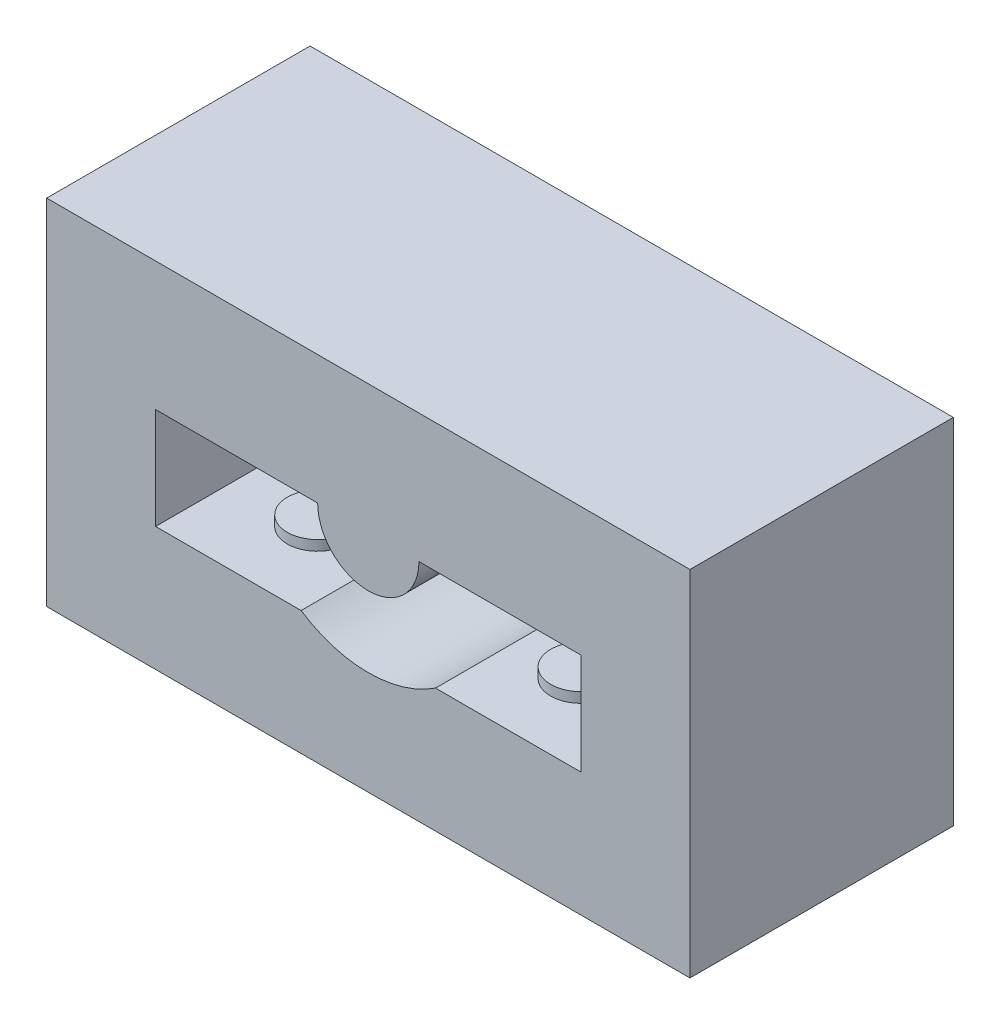
ISO-10303-21;
HEADER;
FILE_DESCRIPTION(('STEP AP214'),'2;1');
FILE_NAME('part.step','',(''),(''),'','','');
FILE_SCHEMA(('AUTOMOTIVE_DESIGN { 1 0 10303 214 1 1 1 1 }'));
ENDSEC;
DATA;
#1=APPLICATION_CONTEXT('core data for automotive mechanical design processes');
#2=APPLICATION_PROTOCOL_DEFINITION('international standard','automotive_design',2000,#1);
#3=PRODUCT_CONTEXT('',#1,'mechanical');
#4=PRODUCT('Part','Part','',(#3));
#5=PRODUCT_RELATED_PRODUCT_CATEGORY('part','',(#4));
#6=PRODUCT_DEFINITION_FORMATION('','',#4);
#7=PRODUCT_DEFINITION_CONTEXT('part definition',#1,'design');
#8=PRODUCT_DEFINITION('design','',#6,#7);
#9=PRODUCT_DEFINITION_SHAPE('','',#8);
#10=(LENGTH_UNIT() NAMED_UNIT(*) SI_UNIT(.MILLI.,.METRE.));
#11=(NAMED_UNIT(*) PLANE_ANGLE_UNIT() SI_UNIT($,.RADIAN.));
#12=(NAMED_UNIT(*) SI_UNIT($,.STERADIAN.) SOLID_ANGLE_UNIT());
#13=UNCERTAINTY_MEASURE_WITH_UNIT(LENGTH_MEASURE(1.E-05),#10,'distance_accuracy_value','');
#14=(GEOMETRIC_REPRESENTATION_CONTEXT(3) GLOBAL_UNCERTAINTY_ASSIGNED_CONTEXT((#13)) GLOBAL_UNIT_ASSIGNED_CONTEXT((#10,
#11,#12)) REPRESENTATION_CONTEXT('',''));
#15=CARTESIAN_POINT('',(0.,0.,0.));
#16=DIRECTION('',(0.,0.,1.));
#17=DIRECTION('',(1.,0.,0.));
#18=AXIS2_PLACEMENT_3D('',#15,#16,#17);
#19=CARTESIAN_POINT('',(3.3166247903554,-5.,13.));
#20=DIRECTION('',(0.,1.,0.));
#21=DIRECTION('',(0.,0.,1.));
#22=AXIS2_PLACEMENT_3D('',#19,#20,#21);
#23=PLANE('',#22);
#24=DIRECTION('',(1.,0.,0.));
#25=VECTOR('',#24,1.);
#26=CARTESIAN_POINT('',(3.3166247903554,-5.,5.));
#27=LINE('',#26,#25);
#28=CARTESIAN_POINT('',(3.3166247903554,-5.,5.));
#29=VERTEX_POINT('',#28);
#30=CARTESIAN_POINT('',(10.5,-5.,5.));
#31=VERTEX_POINT('',#30);
#32=EDGE_CURVE('E173',#29,#31,#27,.T.);
#33=ORIENTED_EDGE('',*,*,#32,.F.);
#34=DIRECTION('',(0.,0.,-1.));
#35=VECTOR('',#34,1.);
#36=CARTESIAN_POINT('',(3.3166247903554,-5.,13.));
#37=LINE('',#36,#35);
#38=CARTESIAN_POINT('',(3.3166247903554,-5.,13.));
#39=VERTEX_POINT('',#38);
#40=EDGE_CURVE('E11',#39,#29,#37,.T.);
#41=ORIENTED_EDGE('',*,*,#40,.F.);
#42=DIRECTION('',(1.,0.,0.));
#43=VECTOR('',#42,1.);
#44=CARTESIAN_POINT('',(3.3166247903554,-5.,13.));
#45=LINE('',#44,#43);
#46=CARTESIAN_POINT('',(10.5,-5.,13.));
#47=VERTEX_POINT('',#46);
#48=EDGE_CURVE('E154',#39,#47,#45,.T.);
#49=ORIENTED_EDGE('',*,*,#48,.T.);
#50=DIRECTION('',(0.,0.,-1.));
#51=VECTOR('',#50,1.);
#52=CARTESIAN_POINT('',(10.5,-5.,13.));
#53=LINE('',#52,#51);
#54=EDGE_CURVE('E39',#47,#31,#53,.T.);
#55=ORIENTED_EDGE('',*,*,#54,.T.);
#56=EDGE_LOOP('',(#33,#41,#49,#55));
#57=FACE_BOUND('',#56,.T.);
#58=CARTESIAN_POINT('',(6.5,-5.,9.));
#59=DIRECTION('',(0.,1.,0.));
#60=DIRECTION('',(0.,0.,1.));
#61=AXIS2_PLACEMENT_3D('',#58,#59,#60);
#62=CIRCLE('',#61,1.5);
#63=CARTESIAN_POINT('',(6.5,-5.,10.5));
#64=VERTEX_POINT('',#63);
#65=EDGE_CURVE('E405',#64,#64,#62,.T.);
#66=ORIENTED_EDGE('',*,*,#65,.F.);
#67=EDGE_LOOP('',(#66));
#68=FACE_BOUND('',#67,.T.);
#69=ADVANCED_FACE('F31',(#57,#68),#23,.T.);
#70=CARTESIAN_POINT('',(-3.3166247903554,-5.,13.));
#71=DIRECTION('',(0.,1.,0.));
#72=DIRECTION('',(0.,0.,1.));
#73=AXIS2_PLACEMENT_3D('',#70,#71,#72);
#74=PLANE('',#73);
#75=DIRECTION('',(1.,0.,0.));
#76=VECTOR('',#75,1.);
#77=CARTESIAN_POINT('',(-3.3166247903554,-5.,5.));
#78=LINE('',#77,#76);
#79=CARTESIAN_POINT('',(-10.5,-5.,5.));
#80=VERTEX_POINT('',#79);
#81=CARTESIAN_POINT('',(-3.3166247903554,-5.,5.));
#82=VERTEX_POINT('',#81);
#83=EDGE_CURVE('E155',#80,#82,#78,.T.);
#84=ORIENTED_EDGE('',*,*,#83,.F.);
#85=DIRECTION('',(0.,0.,-1.));
#86=VECTOR('',#85,1.);
#87=CARTESIAN_POINT('',(-10.5,-5.,13.));
#88=LINE('',#87,#86);
#89=CARTESIAN_POINT('',(-10.5,-5.,13.));
#90=VERTEX_POINT('',#89);
#91=EDGE_CURVE('E189',#90,#80,#88,.T.);
#92=ORIENTED_EDGE('',*,*,#91,.F.);
#93=DIRECTION('',(1.,0.,0.));
#94=VECTOR('',#93,1.);
#95=CARTESIAN_POINT('',(-3.3166247903554,-5.,13.));
#96=LINE('',#95,#94);
#97=CARTESIAN_POINT('',(-3.3166247903554,-5.,13.));
#98=VERTEX_POINT('',#97);
#99=EDGE_CURVE('E168',#90,#98,#96,.T.);
#100=ORIENTED_EDGE('',*,*,#99,.T.);
#101=DIRECTION('',(0.,0.,-1.));
#102=VECTOR('',#101,1.);
#103=CARTESIAN_POINT('',(-3.3166247903554,-5.,13.));
#104=LINE('',#103,#102);
#105=EDGE_CURVE('E170',#98,#82,#104,.T.);
#106=ORIENTED_EDGE('',*,*,#105,.T.);
#107=EDGE_LOOP('',(#84,#92,#100,#106));
#108=FACE_BOUND('',#107,.T.);
#109=CARTESIAN_POINT('',(-6.5,-5.,9.));
#110=DIRECTION('',(0.,1.,0.));
#111=DIRECTION('',(0.,0.,1.));
#112=AXIS2_PLACEMENT_3D('',#109,#110,#111);
#113=CIRCLE('',#112,1.5);
#114=CARTESIAN_POINT('',(-6.5,-5.,10.5));
#115=VERTEX_POINT('',#114);
#116=EDGE_CURVE('E404',#115,#115,#113,.T.);
#117=ORIENTED_EDGE('',*,*,#116,.F.);
#118=EDGE_LOOP('',(#117));
#119=FACE_BOUND('',#118,.T.);
#120=ADVANCED_FACE('F225',(#108,#119),#74,.T.);
#121=CARTESIAN_POINT('',(0.,0.,13.));
#122=DIRECTION('',(0.,0.,1.));
#123=DIRECTION('',(1.,0.,0.));
#124=AXIS2_PLACEMENT_3D('',#121,#122,#123);
#125=PLANE('',#124);
#126=ORIENTED_EDGE('',*,*,#48,.F.);
#127=CARTESIAN_POINT('',(0.,0.,13.));
#128=DIRECTION('',(0.,0.,1.));
#129=DIRECTION('',(-1.,0.,0.));
#130=AXIS2_PLACEMENT_3D('',#127,#128,#129);
#131=CIRCLE('',#130,6.);
#132=EDGE_CURVE('E152',#98,#39,#131,.T.);
#133=ORIENTED_EDGE('',*,*,#132,.F.);
#134=ORIENTED_EDGE('',*,*,#99,.F.);
#135=DIRECTION('',(0.,-1.,0.));
#136=VECTOR('',#135,1.);
#137=CARTESIAN_POINT('',(-10.5,-5.,13.));
#138=LINE('',#137,#136);
#139=CARTESIAN_POINT('',(-10.5,0.,13.));
#140=VERTEX_POINT('',#139);
#141=EDGE_CURVE('E165',#140,#90,#138,.T.);
#142=ORIENTED_EDGE('',*,*,#141,.F.);
#143=DIRECTION('',(-1.,0.,0.));
#144=VECTOR('',#143,1.);
#145=CARTESIAN_POINT('',(-2.5,0.,13.));
#146=LINE('',#145,#144);
#147=CARTESIAN_POINT('',(-2.5,0.,13.));
#148=VERTEX_POINT('',#147);
#149=EDGE_CURVE('E163',#148,#140,#146,.T.);
#150=ORIENTED_EDGE('',*,*,#149,.F.);
#151=CARTESIAN_POINT('',(0.,0.,13.));
#152=DIRECTION('',(0.,0.,-1.));
#153=DIRECTION('',(-1.,0.,0.));
#154=AXIS2_PLACEMENT_3D('',#151,#152,#153);
#155=CIRCLE('',#154,2.5);
#156=CARTESIAN_POINT('',(2.5,0.,13.));
#157=VERTEX_POINT('',#156);
#158=EDGE_CURVE('E161',#157,#148,#155,.T.);
#159=ORIENTED_EDGE('',*,*,#158,.F.);
#160=DIRECTION('',(-1.,0.,0.));
#161=VECTOR('',#160,1.);
#162=CARTESIAN_POINT('',(2.5,0.,13.));
#163=LINE('',#162,#161);
#164=CARTESIAN_POINT('',(10.5,0.,13.));
#165=VERTEX_POINT('',#164);
#166=EDGE_CURVE('E159',#165,#157,#163,.T.);
#167=ORIENTED_EDGE('',*,*,#166,.F.);
#168=DIRECTION('',(0.,1.,0.));
#169=VECTOR('',#168,1.);
#170=CARTESIAN_POINT('',(10.5,0.,13.));
#171=LINE('',#170,#169);
#172=EDGE_CURVE('E157',#47,#165,#171,.T.);
#173=ORIENTED_EDGE('',*,*,#172,.F.);
#174=EDGE_LOOP('',(#126,#133,#134,#142,#150,#159,#167,#173));
#175=FACE_BOUND('',#174,.T.);
#176=DIRECTION('',(0.,-1.,0.));
#177=VECTOR('',#176,1.);
#178=CARTESIAN_POINT('',(-15.875,-11.1125,13.));
#179=LINE('',#178,#177);
#180=CARTESIAN_POINT('',(-15.875,6.35,13.));
#181=VERTEX_POINT('',#180);
#182=CARTESIAN_POINT('',(-15.875,-11.1125,13.));
#183=VERTEX_POINT('',#182);
#184=EDGE_CURVE('E140',#181,#183,#179,.T.);
#185=ORIENTED_EDGE('',*,*,#184,.T.);
#186=DIRECTION('',(1.,0.,0.));
#187=VECTOR('',#186,1.);
#188=CARTESIAN_POINT('',(15.875,-11.1125,13.));
#189=LINE('',#188,#187);
#190=CARTESIAN_POINT('',(15.875,-11.1125,13.));
#191=VERTEX_POINT('',#190);
#192=EDGE_CURVE('E54',#183,#191,#189,.T.);
#193=ORIENTED_EDGE('',*,*,#192,.T.);
#194=DIRECTION('',(0.,1.,0.));
#195=VECTOR('',#194,1.);
#196=CARTESIAN_POINT('',(15.875,6.35,13.));
#197=LINE('',#196,#195);
#198=CARTESIAN_POINT('',(15.875,6.35,13.));
#199=VERTEX_POINT('',#198);
#200=EDGE_CURVE('E130',#191,#199,#197,.T.);
#201=ORIENTED_EDGE('',*,*,#200,.T.);
#202=DIRECTION('',(-1.,0.,0.));
#203=VECTOR('',#202,1.);
#204=CARTESIAN_POINT('',(-15.875,6.35,13.));
#205=LINE('',#204,#203);
#206=EDGE_CURVE('E136',#199,#181,#205,.T.);
#207=ORIENTED_EDGE('',*,*,#206,.T.);
#208=EDGE_LOOP('',(#185,#193,#201,#207));
#209=FACE_BOUND('',#208,.T.);
#210=ADVANCED_FACE('F139',(#175,#209),#125,.T.);
#211=CARTESIAN_POINT('',(0.,0.,13.));
#212=DIRECTION('',(0.,0.,-1.));
#213=DIRECTION('',(-1.,0.,0.));
#214=AXIS2_PLACEMENT_3D('',#211,#212,#213);
#215=CYLINDRICAL_SURFACE('',#214,6.);
#216=CARTESIAN_POINT('',(0.,0.,5.));
#217=DIRECTION('',(0.,0.,1.));
#218=DIRECTION('',(-1.,0.,0.));
#219=AXIS2_PLACEMENT_3D('',#216,#217,#218);
#220=CIRCLE('',#219,6.);
#221=EDGE_CURVE('E171',#82,#29,#220,.T.);
#222=ORIENTED_EDGE('',*,*,#221,.F.);
#223=ORIENTED_EDGE('',*,*,#105,.F.);
#224=ORIENTED_EDGE('',*,*,#132,.T.);
#225=ORIENTED_EDGE('',*,*,#40,.T.);
#226=EDGE_LOOP('',(#222,#223,#224,#225));
#227=FACE_BOUND('',#226,.T.);
#228=ADVANCED_FACE('F222',(#227),#215,.F.);
#229=CARTESIAN_POINT('',(10.5,0.,13.));
#230=DIRECTION('',(-1.,0.,0.));
#231=DIRECTION('',(0.,0.,1.));
#232=AXIS2_PLACEMENT_3D('',#229,#230,#231);
#233=PLANE('',#232);
#234=DIRECTION('',(0.,1.,0.));
#235=VECTOR('',#234,1.);
#236=CARTESIAN_POINT('',(10.5,0.,5.));
#237=LINE('',#236,#235);
#238=CARTESIAN_POINT('',(10.5,0.,5.));
#239=VERTEX_POINT('',#238);
#240=EDGE_CURVE('E176',#31,#239,#237,.T.);
#241=ORIENTED_EDGE('',*,*,#240,.F.);
#242=ORIENTED_EDGE('',*,*,#54,.F.);
#243=ORIENTED_EDGE('',*,*,#172,.T.);
#244=DIRECTION('',(0.,0.,-1.));
#245=VECTOR('',#244,1.);
#246=CARTESIAN_POINT('',(10.5,0.,13.));
#247=LINE('',#246,#245);
#248=EDGE_CURVE('E201',#165,#239,#247,.T.);
#249=ORIENTED_EDGE('',*,*,#248,.T.);
#250=EDGE_LOOP('',(#241,#242,#243,#249));
#251=FACE_BOUND('',#250,.T.);
#252=ADVANCED_FACE('F213',(#251),#233,.T.);
#253=CARTESIAN_POINT('',(2.5,0.,13.));
#254=DIRECTION('',(0.,-1.,0.));
#255=DIRECTION('',(0.,0.,-1.));
#256=AXIS2_PLACEMENT_3D('',#253,#254,#255);
#257=PLANE('',#256);
#258=DIRECTION('',(-1.,0.,0.));
#259=VECTOR('',#258,1.);
#260=CARTESIAN_POINT('',(2.5,0.,5.));
#261=LINE('',#260,#259);
#262=CARTESIAN_POINT('',(2.5,0.,5.));
#263=VERTEX_POINT('',#262);
#264=EDGE_CURVE('E178',#239,#263,#261,.T.);
#265=ORIENTED_EDGE('',*,*,#264,.F.);
#266=ORIENTED_EDGE('',*,*,#248,.F.);
#267=ORIENTED_EDGE('',*,*,#166,.T.);
#268=DIRECTION('',(0.,0.,-1.));
#269=VECTOR('',#268,1.);
#270=CARTESIAN_POINT('',(2.5,0.,13.));
#271=LINE('',#270,#269);
#272=EDGE_CURVE('E198',#157,#263,#271,.T.);
#273=ORIENTED_EDGE('',*,*,#272,.T.);
#274=EDGE_LOOP('',(#265,#266,#267,#273));
#275=FACE_BOUND('',#274,.T.);
#276=ADVANCED_FACE('F234',(#275),#257,.T.);
#277=CARTESIAN_POINT('',(0.,0.,13.));
#278=DIRECTION('',(0.,0.,-1.));
#279=DIRECTION('',(-1.,0.,0.));
#280=AXIS2_PLACEMENT_3D('',#277,#278,#279);
#281=CYLINDRICAL_SURFACE('',#280,2.5);
#282=CARTESIAN_POINT('',(0.,0.,5.));
#283=DIRECTION('',(0.,0.,-1.));
#284=DIRECTION('',(-1.,0.,0.));
#285=AXIS2_PLACEMENT_3D('',#282,#283,#284);
#286=CIRCLE('',#285,2.5);
#287=CARTESIAN_POINT('',(-2.5,0.,5.));
#288=VERTEX_POINT('',#287);
#289=EDGE_CURVE('E180',#263,#288,#286,.T.);
#290=ORIENTED_EDGE('',*,*,#289,.F.);
#291=ORIENTED_EDGE('',*,*,#272,.F.);
#292=ORIENTED_EDGE('',*,*,#158,.T.);
#293=DIRECTION('',(0.,0.,-1.));
#294=VECTOR('',#293,1.);
#295=CARTESIAN_POINT('',(-2.5,0.,13.));
#296=LINE('',#295,#294);
#297=EDGE_CURVE('E195',#148,#288,#296,.T.);
#298=ORIENTED_EDGE('',*,*,#297,.T.);
#299=EDGE_LOOP('',(#290,#291,#292,#298));
#300=FACE_BOUND('',#299,.T.);
#301=ADVANCED_FACE('F238',(#300),#281,.T.);
#302=CARTESIAN_POINT('',(-2.5,0.,13.));
#303=DIRECTION('',(0.,-1.,0.));
#304=DIRECTION('',(1.,0.,0.));
#305=AXIS2_PLACEMENT_3D('',#302,#303,#304);
#306=PLANE('',#305);
#307=DIRECTION('',(-1.,0.,0.));
#308=VECTOR('',#307,1.);
#309=CARTESIAN_POINT('',(-2.5,0.,5.));
#310=LINE('',#309,#308);
#311=CARTESIAN_POINT('',(-10.5,0.,5.));
#312=VERTEX_POINT('',#311);
#313=EDGE_CURVE('E182',#288,#312,#310,.T.);
#314=ORIENTED_EDGE('',*,*,#313,.F.);
#315=ORIENTED_EDGE('',*,*,#297,.F.);
#316=ORIENTED_EDGE('',*,*,#149,.T.);
#317=DIRECTION('',(0.,0.,-1.));
#318=VECTOR('',#317,1.);
#319=CARTESIAN_POINT('',(-10.5,0.,13.));
#320=LINE('',#319,#318);
#321=EDGE_CURVE('E192',#140,#312,#320,.T.);
#322=ORIENTED_EDGE('',*,*,#321,.T.);
#323=EDGE_LOOP('',(#314,#315,#316,#322));
#324=FACE_BOUND('',#323,.T.);
#325=ADVANCED_FACE('F244',(#324),#306,.T.);
#326=CARTESIAN_POINT('',(-10.5,-5.,13.));
#327=DIRECTION('',(1.,0.,0.));
#328=DIRECTION('',(0.,0.,-1.));
#329=AXIS2_PLACEMENT_3D('',#326,#327,#328);
#330=PLANE('',#329);
#331=DIRECTION('',(0.,-1.,0.));
#332=VECTOR('',#331,1.);
#333=CARTESIAN_POINT('',(-10.5,-5.,5.));
#334=LINE('',#333,#332);
#335=EDGE_CURVE('E184',#312,#80,#334,.T.);
#336=ORIENTED_EDGE('',*,*,#335,.F.);
#337=ORIENTED_EDGE('',*,*,#321,.F.);
#338=ORIENTED_EDGE('',*,*,#141,.T.);
#339=ORIENTED_EDGE('',*,*,#91,.T.);
#340=EDGE_LOOP('',(#336,#337,#338,#339));
#341=FACE_BOUND('',#340,.T.);
#342=ADVANCED_FACE('F246',(#341),#330,.T.);
#343=CARTESIAN_POINT('',(0.,0.,5.));
#344=DIRECTION('',(0.,0.,1.));
#345=DIRECTION('',(1.,0.,0.));
#346=AXIS2_PLACEMENT_3D('',#343,#344,#345);
#347=PLANE('',#346);
#348=ORIENTED_EDGE('',*,*,#221,.T.);
#349=ORIENTED_EDGE('',*,*,#32,.T.);
#350=ORIENTED_EDGE('',*,*,#240,.T.);
#351=ORIENTED_EDGE('',*,*,#264,.T.);
#352=ORIENTED_EDGE('',*,*,#289,.T.);
#353=ORIENTED_EDGE('',*,*,#313,.T.);
#354=ORIENTED_EDGE('',*,*,#335,.T.);
#355=ORIENTED_EDGE('',*,*,#83,.T.);
#356=EDGE_LOOP('',(#348,#349,#350,#351,#352,#353,#354,#355));
#357=FACE_BOUND('',#356,.T.);
#358=ADVANCED_FACE('F217',(#357),#347,.T.);
#359=CARTESIAN_POINT('',(15.875,-11.1125,-67.8822509939086));
#360=DIRECTION('',(0.,-1.,0.));
#361=DIRECTION('',(1.,0.,0.));
#362=AXIS2_PLACEMENT_3D('',#359,#360,#361);
#363=PLANE('',#362);
#364=DIRECTION('',(0.,0.,1.));
#365=VECTOR('',#364,1.);
#366=CARTESIAN_POINT('',(15.875,-11.1125,-67.8822509939086));
#367=LINE('',#366,#365);
#368=CARTESIAN_POINT('',(15.875,-11.1125,0.));
#369=VERTEX_POINT('',#368);
#370=EDGE_CURVE('E119',#369,#191,#367,.T.);
#371=ORIENTED_EDGE('',*,*,#370,.T.);
#372=ORIENTED_EDGE('',*,*,#192,.F.);
#373=DIRECTION('',(0.,0.,1.));
#374=VECTOR('',#373,1.);
#375=CARTESIAN_POINT('',(-15.875,-11.1125,-67.8822509939086));
#376=LINE('',#375,#374);
#377=CARTESIAN_POINT('',(-15.875,-11.1125,0.));
#378=VERTEX_POINT('',#377);
#379=EDGE_CURVE('E127',#378,#183,#376,.T.);
#380=ORIENTED_EDGE('',*,*,#379,.F.);
#381=DIRECTION('',(-1.,0.,0.));
#382=VECTOR('',#381,1.);
#383=CARTESIAN_POINT('',(15.875,-11.1125,0.));
#384=LINE('',#383,#382);
#385=EDGE_CURVE('E123',#369,#378,#384,.T.);
#386=ORIENTED_EDGE('',*,*,#385,.F.);
#387=EDGE_LOOP('',(#371,#372,#380,#386));
#388=FACE_BOUND('',#387,.T.);
#389=ADVANCED_FACE('F121',(#388),#363,.T.);
#390=CARTESIAN_POINT('',(15.875,6.35,-67.8822509939086));
#391=DIRECTION('',(1.,0.,0.));
#392=DIRECTION('',(0.,0.,-1.));
#393=AXIS2_PLACEMENT_3D('',#390,#391,#392);
#394=PLANE('',#393);
#395=DIRECTION('',(0.,0.,1.));
#396=VECTOR('',#395,1.);
#397=CARTESIAN_POINT('',(15.875,6.35,-67.8822509939086));
#398=LINE('',#397,#396);
#399=CARTESIAN_POINT('',(15.875,6.35,0.));
#400=VERTEX_POINT('',#399);
#401=EDGE_CURVE('E126',#400,#199,#398,.T.);
#402=ORIENTED_EDGE('',*,*,#401,.T.);
#403=ORIENTED_EDGE('',*,*,#200,.F.);
#404=ORIENTED_EDGE('',*,*,#370,.F.);
#405=DIRECTION('',(0.,-1.,0.));
#406=VECTOR('',#405,1.);
#407=CARTESIAN_POINT('',(15.875,6.35,0.));
#408=LINE('',#407,#406);
#409=EDGE_CURVE('E174',#400,#369,#408,.T.);
#410=ORIENTED_EDGE('',*,*,#409,.F.);
#411=EDGE_LOOP('',(#402,#403,#404,#410));
#412=FACE_BOUND('',#411,.T.);
#413=ADVANCED_FACE('F131',(#412),#394,.T.);
#414=CARTESIAN_POINT('',(-15.875,6.35,-67.8822509939086));
#415=DIRECTION('',(0.,1.,0.));
#416=DIRECTION('',(0.,0.,1.));
#417=AXIS2_PLACEMENT_3D('',#414,#415,#416);
#418=PLANE('',#417);
#419=DIRECTION('',(0.,0.,1.));
#420=VECTOR('',#419,1.);
#421=CARTESIAN_POINT('',(-15.875,6.35,-67.8822509939086));
#422=LINE('',#421,#420);
#423=CARTESIAN_POINT('',(-15.875,6.35,0.));
#424=VERTEX_POINT('',#423);
#425=EDGE_CURVE('E46',#424,#181,#422,.T.);
#426=ORIENTED_EDGE('',*,*,#425,.T.);
#427=ORIENTED_EDGE('',*,*,#206,.F.);
#428=ORIENTED_EDGE('',*,*,#401,.F.);
#429=DIRECTION('',(1.,0.,0.));
#430=VECTOR('',#429,1.);
#431=CARTESIAN_POINT('',(-15.875,6.35,0.));
#432=LINE('',#431,#430);
#433=EDGE_CURVE('E415',#424,#400,#432,.T.);
#434=ORIENTED_EDGE('',*,*,#433,.F.);
#435=EDGE_LOOP('',(#426,#427,#428,#434));
#436=FACE_BOUND('',#435,.T.);
#437=ADVANCED_FACE('F318',(#436),#418,.T.);
#438=CARTESIAN_POINT('',(-15.875,-11.1125,-67.8822509939086));
#439=DIRECTION('',(-1.,0.,0.));
#440=DIRECTION('',(0.,0.,1.));
#441=AXIS2_PLACEMENT_3D('',#438,#439,#440);
#442=PLANE('',#441);
#443=ORIENTED_EDGE('',*,*,#379,.T.);
#444=ORIENTED_EDGE('',*,*,#184,.F.);
#445=ORIENTED_EDGE('',*,*,#425,.F.);
#446=DIRECTION('',(0.,1.,0.));
#447=VECTOR('',#446,1.);
#448=CARTESIAN_POINT('',(-15.875,-11.1125,0.));
#449=LINE('',#448,#447);
#450=EDGE_CURVE('E151',#378,#424,#449,.T.);
#451=ORIENTED_EDGE('',*,*,#450,.F.);
#452=EDGE_LOOP('',(#443,#444,#445,#451));
#453=FACE_BOUND('',#452,.T.);
#454=ADVANCED_FACE('F325',(#453),#442,.T.);
#455=CARTESIAN_POINT('',(0.,0.,0.));
#456=DIRECTION('',(0.,0.,1.));
#457=DIRECTION('',(1.,0.,0.));
#458=AXIS2_PLACEMENT_3D('',#455,#456,#457);
#459=PLANE('',#458);
#460=ORIENTED_EDGE('',*,*,#385,.T.);
#461=ORIENTED_EDGE('',*,*,#450,.T.);
#462=ORIENTED_EDGE('',*,*,#433,.T.);
#463=ORIENTED_EDGE('',*,*,#409,.T.);
#464=EDGE_LOOP('',(#460,#461,#462,#463));
#465=FACE_BOUND('',#464,.T.);
#466=ADVANCED_FACE('F33',(#465),#459,.F.);
#467=CARTESIAN_POINT('',(-6.5,-4.5,9.));
#468=DIRECTION('',(0.,-1.,0.));
#469=DIRECTION('',(0.,0.,-1.));
#470=AXIS2_PLACEMENT_3D('',#467,#468,#469);
#471=CYLINDRICAL_SURFACE('',#470,1.5);
#472=CARTESIAN_POINT('',(-6.5,-4.5,9.));
#473=DIRECTION('',(0.,1.,0.));
#474=DIRECTION('',(0.,0.,1.));
#475=AXIS2_PLACEMENT_3D('',#472,#473,#474);
#476=CIRCLE('',#475,1.5);
#477=CARTESIAN_POINT('',(-6.5,-4.5,10.5));
#478=VERTEX_POINT('',#477);
#479=EDGE_CURVE('E142',#478,#478,#476,.T.);
#480=ORIENTED_EDGE('',*,*,#479,.F.);
#481=EDGE_LOOP('',(#480));
#482=FACE_BOUND('',#481,.T.);
#483=ORIENTED_EDGE('',*,*,#116,.T.);
#484=EDGE_LOOP('',(#483));
#485=FACE_BOUND('',#484,.T.);
#486=ADVANCED_FACE('F339',(#482,#485),#471,.T.);
#487=CARTESIAN_POINT('',(-6.5,-4.5,9.));
#488=DIRECTION('',(0.,1.,0.));
#489=DIRECTION('',(0.,0.,1.));
#490=AXIS2_PLACEMENT_3D('',#487,#488,#489);
#491=PLANE('',#490);
#492=ORIENTED_EDGE('',*,*,#479,.T.);
#493=EDGE_LOOP('',(#492));
#494=FACE_BOUND('',#493,.T.);
#495=ADVANCED_FACE('F346',(#494),#491,.T.);
#496=CARTESIAN_POINT('',(6.5,-4.5,9.));
#497=DIRECTION('',(0.,-1.,0.));
#498=DIRECTION('',(0.,0.,-1.));
#499=AXIS2_PLACEMENT_3D('',#496,#497,#498);
#500=CYLINDRICAL_SURFACE('',#499,1.5);
#501=CARTESIAN_POINT('',(6.5,-4.5,9.));
#502=DIRECTION('',(0.,1.,0.));
#503=DIRECTION('',(0.,0.,1.));
#504=AXIS2_PLACEMENT_3D('',#501,#502,#503);
#505=CIRCLE('',#504,1.5);
#506=CARTESIAN_POINT('',(6.5,-4.5,10.5));
#507=VERTEX_POINT('',#506);
#508=EDGE_CURVE('E403',#507,#507,#505,.T.);
#509=ORIENTED_EDGE('',*,*,#508,.F.);
#510=EDGE_LOOP('',(#509));
#511=FACE_BOUND('',#510,.T.);
#512=ORIENTED_EDGE('',*,*,#65,.T.);
#513=EDGE_LOOP('',(#512));
#514=FACE_BOUND('',#513,.T.);
#515=ADVANCED_FACE('F354',(#511,#514),#500,.T.);
#516=CARTESIAN_POINT('',(6.5,-4.5,9.));
#517=DIRECTION('',(0.,1.,0.));
#518=DIRECTION('',(0.,0.,1.));
#519=AXIS2_PLACEMENT_3D('',#516,#517,#518);
#520=PLANE('',#519);
#521=ORIENTED_EDGE('',*,*,#508,.T.);
#522=EDGE_LOOP('',(#521));
#523=FACE_BOUND('',#522,.T.);
#524=ADVANCED_FACE('F362',(#523),#520,.T.);
#525=CLOSED_SHELL('',(#69,#120,#210,#228,#252,#276,#301,#325,#342,#358,#389,#413,#437,#454,#466,
#486,#495,#515,#524));
#526=MANIFOLD_SOLID_BREP('B2',#525);
#527=ADVANCED_BREP_SHAPE_REPRESENTATION('',(#18,#526),#14);
#528=SHAPE_DEFINITION_REPRESENTATION(#9,#527);
ENDSEC;
END-ISO-10303-21;
